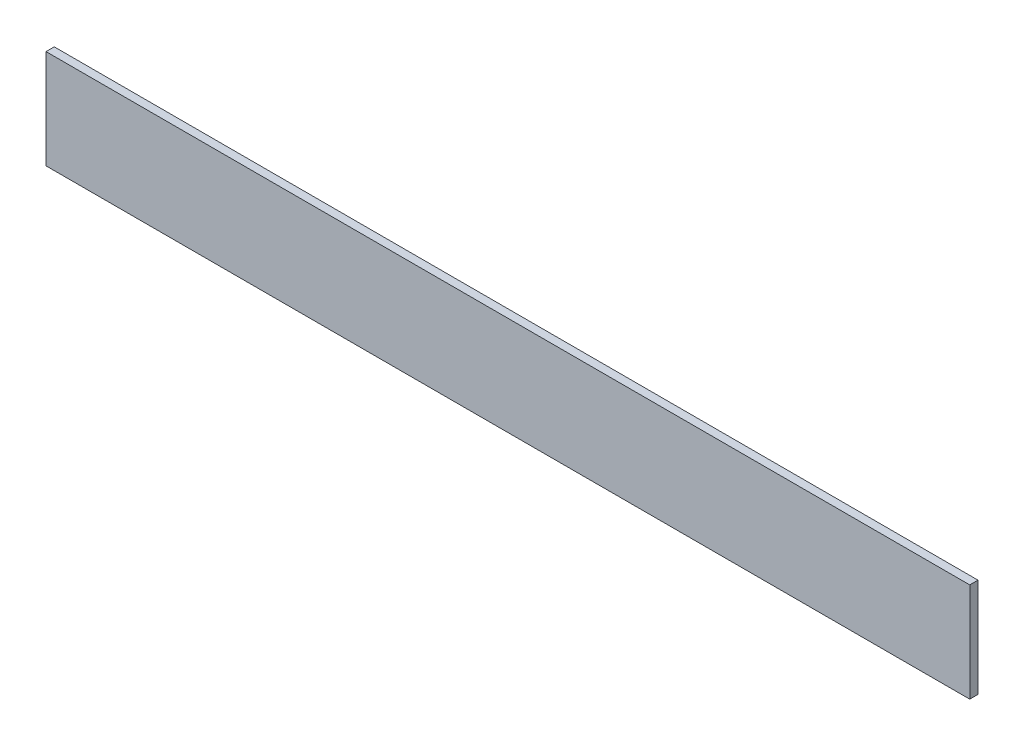
ISO-10303-21;
HEADER;
FILE_DESCRIPTION(('STEP AP214'),'2;1');
FILE_NAME('part.step','',(''),(''),'','','');
FILE_SCHEMA(('AUTOMOTIVE_DESIGN { 1 0 10303 214 1 1 1 1 }'));
ENDSEC;
DATA;
#1=APPLICATION_CONTEXT('core data for automotive mechanical design processes');
#2=APPLICATION_PROTOCOL_DEFINITION('international standard','automotive_design',2000,#1);
#3=PRODUCT_CONTEXT('',#1,'mechanical');
#4=PRODUCT('Part','Part','',(#3));
#5=PRODUCT_RELATED_PRODUCT_CATEGORY('part','',(#4));
#6=PRODUCT_DEFINITION_FORMATION('','',#4);
#7=PRODUCT_DEFINITION_CONTEXT('part definition',#1,'design');
#8=PRODUCT_DEFINITION('design','',#6,#7);
#9=PRODUCT_DEFINITION_SHAPE('','',#8);
#10=(LENGTH_UNIT() NAMED_UNIT(*) SI_UNIT(.MILLI.,.METRE.));
#11=(NAMED_UNIT(*) PLANE_ANGLE_UNIT() SI_UNIT($,.RADIAN.));
#12=(NAMED_UNIT(*) SI_UNIT($,.STERADIAN.) SOLID_ANGLE_UNIT());
#13=UNCERTAINTY_MEASURE_WITH_UNIT(LENGTH_MEASURE(1.E-05),#10,'distance_accuracy_value','');
#14=(GEOMETRIC_REPRESENTATION_CONTEXT(3) GLOBAL_UNCERTAINTY_ASSIGNED_CONTEXT((#13)) GLOBAL_UNIT_ASSIGNED_CONTEXT((#10,
#11,#12)) REPRESENTATION_CONTEXT('',''));
#15=CARTESIAN_POINT('',(0.,0.,0.));
#16=DIRECTION('',(0.,0.,1.));
#17=DIRECTION('',(1.,0.,0.));
#18=AXIS2_PLACEMENT_3D('',#15,#16,#17);
#19=CARTESIAN_POINT('',(711.2,-38.1,-3.175));
#20=DIRECTION('',(0.,0.,1.));
#21=DIRECTION('',(1.,0.,0.));
#22=AXIS2_PLACEMENT_3D('',#19,#20,#21);
#23=PLANE('',#22);
#24=DIRECTION('',(0.,1.,0.));
#25=VECTOR('',#24,1.);
#26=CARTESIAN_POINT('',(0.,-38.1,-3.175));
#27=LINE('',#26,#25);
#28=CARTESIAN_POINT('',(0.,-38.1,-3.175));
#29=VERTEX_POINT('',#28);
#30=CARTESIAN_POINT('',(0.,38.1,-3.175));
#31=VERTEX_POINT('',#30);
#32=EDGE_CURVE('E98',#29,#31,#27,.T.);
#33=ORIENTED_EDGE('',*,*,#32,.T.);
#34=DIRECTION('',(-1.,0.,0.));
#35=VECTOR('',#34,1.);
#36=CARTESIAN_POINT('',(711.2,38.1,-3.175));
#37=LINE('',#36,#35);
#38=CARTESIAN_POINT('',(711.2,38.1,-3.175));
#39=VERTEX_POINT('',#38);
#40=EDGE_CURVE('E11',#39,#31,#37,.T.);
#41=ORIENTED_EDGE('',*,*,#40,.F.);
#42=DIRECTION('',(0.,1.,0.));
#43=VECTOR('',#42,1.);
#44=CARTESIAN_POINT('',(711.2,-38.1,-3.175));
#45=LINE('',#44,#43);
#46=CARTESIAN_POINT('',(711.2,-38.1,-3.175));
#47=VERTEX_POINT('',#46);
#48=EDGE_CURVE('E86',#47,#39,#45,.T.);
#49=ORIENTED_EDGE('',*,*,#48,.F.);
#50=DIRECTION('',(-1.,0.,0.));
#51=VECTOR('',#50,1.);
#52=CARTESIAN_POINT('',(711.2,-38.1,-3.175));
#53=LINE('',#52,#51);
#54=EDGE_CURVE('E94',#47,#29,#53,.T.);
#55=ORIENTED_EDGE('',*,*,#54,.T.);
#56=EDGE_LOOP('',(#33,#41,#49,#55));
#57=FACE_BOUND('',#56,.T.);
#58=ADVANCED_FACE('F35',(#57),#23,.F.);
#59=CARTESIAN_POINT('',(711.2,38.1,3.175));
#60=DIRECTION('',(0.,-1.,0.));
#61=DIRECTION('',(0.,0.,-1.));
#62=AXIS2_PLACEMENT_3D('',#59,#60,#61);
#63=PLANE('',#62);
#64=DIRECTION('',(0.,0.,1.));
#65=VECTOR('',#64,1.);
#66=CARTESIAN_POINT('',(0.,38.1,3.175));
#67=LINE('',#66,#65);
#68=CARTESIAN_POINT('',(0.,38.1,3.175));
#69=VERTEX_POINT('',#68);
#70=EDGE_CURVE('E90',#31,#69,#67,.T.);
#71=ORIENTED_EDGE('',*,*,#70,.T.);
#72=DIRECTION('',(-1.,0.,0.));
#73=VECTOR('',#72,1.);
#74=CARTESIAN_POINT('',(711.2,38.1,3.175));
#75=LINE('',#74,#73);
#76=CARTESIAN_POINT('',(711.2,38.1,3.175));
#77=VERTEX_POINT('',#76);
#78=EDGE_CURVE('E43',#77,#69,#75,.T.);
#79=ORIENTED_EDGE('',*,*,#78,.F.);
#80=DIRECTION('',(0.,0.,1.));
#81=VECTOR('',#80,1.);
#82=CARTESIAN_POINT('',(711.2,38.1,3.175));
#83=LINE('',#82,#81);
#84=EDGE_CURVE('E81',#39,#77,#83,.T.);
#85=ORIENTED_EDGE('',*,*,#84,.F.);
#86=ORIENTED_EDGE('',*,*,#40,.T.);
#87=EDGE_LOOP('',(#71,#79,#85,#86));
#88=FACE_BOUND('',#87,.T.);
#89=ADVANCED_FACE('F89',(#88),#63,.F.);
#90=CARTESIAN_POINT('',(711.2,-38.1,3.175));
#91=DIRECTION('',(0.,0.,-1.));
#92=DIRECTION('',(-1.,0.,0.));
#93=AXIS2_PLACEMENT_3D('',#90,#91,#92);
#94=PLANE('',#93);
#95=DIRECTION('',(0.,-1.,0.));
#96=VECTOR('',#95,1.);
#97=CARTESIAN_POINT('',(0.,-38.1,3.175));
#98=LINE('',#97,#96);
#99=CARTESIAN_POINT('',(0.,-38.1,3.175));
#100=VERTEX_POINT('',#99);
#101=EDGE_CURVE('E68',#69,#100,#98,.T.);
#102=ORIENTED_EDGE('',*,*,#101,.T.);
#103=DIRECTION('',(-1.,0.,0.));
#104=VECTOR('',#103,1.);
#105=CARTESIAN_POINT('',(711.2,-38.1,3.175));
#106=LINE('',#105,#104);
#107=CARTESIAN_POINT('',(711.2,-38.1,3.175));
#108=VERTEX_POINT('',#107);
#109=EDGE_CURVE('E91',#108,#100,#106,.T.);
#110=ORIENTED_EDGE('',*,*,#109,.F.);
#111=DIRECTION('',(0.,-1.,0.));
#112=VECTOR('',#111,1.);
#113=CARTESIAN_POINT('',(711.2,-38.1,3.175));
#114=LINE('',#113,#112);
#115=EDGE_CURVE('E84',#77,#108,#114,.T.);
#116=ORIENTED_EDGE('',*,*,#115,.F.);
#117=ORIENTED_EDGE('',*,*,#78,.T.);
#118=EDGE_LOOP('',(#102,#110,#116,#117));
#119=FACE_BOUND('',#118,.T.);
#120=ADVANCED_FACE('F92',(#119),#94,.F.);
#121=CARTESIAN_POINT('',(711.2,-38.1,3.175));
#122=DIRECTION('',(0.,1.,0.));
#123=DIRECTION('',(0.,0.,1.));
#124=AXIS2_PLACEMENT_3D('',#121,#122,#123);
#125=PLANE('',#124);
#126=DIRECTION('',(0.,0.,-1.));
#127=VECTOR('',#126,1.);
#128=CARTESIAN_POINT('',(0.,-38.1,3.175));
#129=LINE('',#128,#127);
#130=EDGE_CURVE('E74',#100,#29,#129,.T.);
#131=ORIENTED_EDGE('',*,*,#130,.T.);
#132=ORIENTED_EDGE('',*,*,#54,.F.);
#133=DIRECTION('',(0.,0.,-1.));
#134=VECTOR('',#133,1.);
#135=CARTESIAN_POINT('',(711.2,-38.1,3.175));
#136=LINE('',#135,#134);
#137=EDGE_CURVE('E51',#108,#47,#136,.T.);
#138=ORIENTED_EDGE('',*,*,#137,.F.);
#139=ORIENTED_EDGE('',*,*,#109,.T.);
#140=EDGE_LOOP('',(#131,#132,#138,#139));
#141=FACE_BOUND('',#140,.T.);
#142=ADVANCED_FACE('F105',(#141),#125,.F.);
#143=CARTESIAN_POINT('',(711.2,0.,0.));
#144=DIRECTION('',(-1.,0.,0.));
#145=DIRECTION('',(0.,0.,1.));
#146=AXIS2_PLACEMENT_3D('',#143,#144,#145);
#147=PLANE('',#146);
#148=ORIENTED_EDGE('',*,*,#48,.T.);
#149=ORIENTED_EDGE('',*,*,#84,.T.);
#150=ORIENTED_EDGE('',*,*,#115,.T.);
#151=ORIENTED_EDGE('',*,*,#137,.T.);
#152=EDGE_LOOP('',(#148,#149,#150,#151));
#153=FACE_BOUND('',#152,.T.);
#154=ADVANCED_FACE('F82',(#153),#147,.F.);
#155=CARTESIAN_POINT('',(0.,0.,0.));
#156=DIRECTION('',(-1.,0.,0.));
#157=DIRECTION('',(0.,0.,1.));
#158=AXIS2_PLACEMENT_3D('',#155,#156,#157);
#159=PLANE('',#158);
#160=ORIENTED_EDGE('',*,*,#32,.F.);
#161=ORIENTED_EDGE('',*,*,#130,.F.);
#162=ORIENTED_EDGE('',*,*,#101,.F.);
#163=ORIENTED_EDGE('',*,*,#70,.F.);
#164=EDGE_LOOP('',(#160,#161,#162,#163));
#165=FACE_BOUND('',#164,.T.);
#166=ADVANCED_FACE('F108',(#165),#159,.T.);
#167=CLOSED_SHELL('',(#58,#89,#120,#142,#154,#166));
#168=MANIFOLD_SOLID_BREP('B2',#167);
#169=ADVANCED_BREP_SHAPE_REPRESENTATION('',(#18,#168),#14);
#170=SHAPE_DEFINITION_REPRESENTATION(#9,#169);
ENDSEC;
END-ISO-10303-21;
